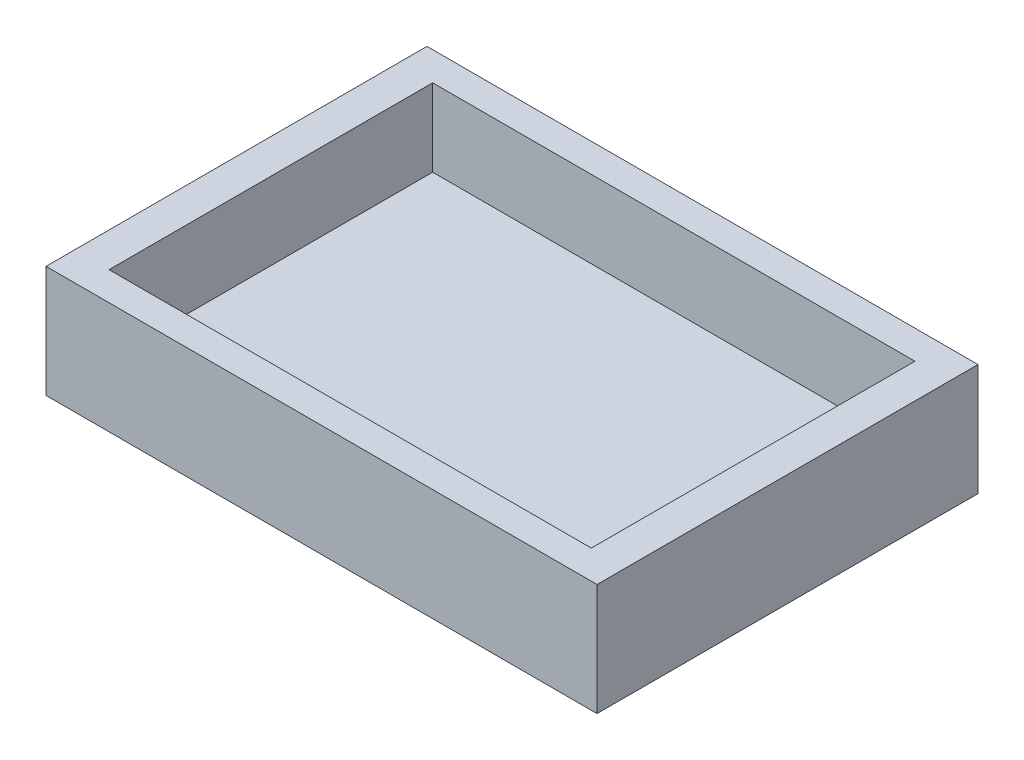
ISO-10303-21;
HEADER;
FILE_DESCRIPTION(('STEP AP214'),'2;1');
FILE_NAME('part.step','',(''),(''),'','','');
FILE_SCHEMA(('AUTOMOTIVE_DESIGN { 1 0 10303 214 1 1 1 1 }'));
ENDSEC;
DATA;
#1=APPLICATION_CONTEXT('core data for automotive mechanical design processes');
#2=APPLICATION_PROTOCOL_DEFINITION('international standard','automotive_design',2000,#1);
#3=PRODUCT_CONTEXT('',#1,'mechanical');
#4=PRODUCT('Part','Part','',(#3));
#5=PRODUCT_RELATED_PRODUCT_CATEGORY('part','',(#4));
#6=PRODUCT_DEFINITION_FORMATION('','',#4);
#7=PRODUCT_DEFINITION_CONTEXT('part definition',#1,'design');
#8=PRODUCT_DEFINITION('design','',#6,#7);
#9=PRODUCT_DEFINITION_SHAPE('','',#8);
#10=(LENGTH_UNIT() NAMED_UNIT(*) SI_UNIT(.MILLI.,.METRE.));
#11=(NAMED_UNIT(*) PLANE_ANGLE_UNIT() SI_UNIT($,.RADIAN.));
#12=(NAMED_UNIT(*) SI_UNIT($,.STERADIAN.) SOLID_ANGLE_UNIT());
#13=UNCERTAINTY_MEASURE_WITH_UNIT(LENGTH_MEASURE(1.E-05),#10,'distance_accuracy_value','');
#14=(GEOMETRIC_REPRESENTATION_CONTEXT(3) GLOBAL_UNCERTAINTY_ASSIGNED_CONTEXT((#13)) GLOBAL_UNIT_ASSIGNED_CONTEXT((#10,
#11,#12)) REPRESENTATION_CONTEXT('',''));
#15=CARTESIAN_POINT('',(0.,0.,0.));
#16=DIRECTION('',(0.,0.,1.));
#17=DIRECTION('',(1.,0.,0.));
#18=AXIS2_PLACEMENT_3D('',#15,#16,#17);
#19=CARTESIAN_POINT('',(48.8,6.,28.218726945));
#20=DIRECTION('',(0.,0.,1.));
#21=DIRECTION('',(1.,0.,0.));
#22=AXIS2_PLACEMENT_3D('',#19,#20,#21);
#23=PLANE('',#22);
#24=DIRECTION('',(0.,-1.,0.));
#25=VECTOR('',#24,1.);
#26=CARTESIAN_POINT('',(42.05,19.5,28.218726945));
#27=LINE('',#26,#25);
#28=CARTESIAN_POINT('',(42.05,19.5,28.218726945));
#29=VERTEX_POINT('',#28);
#30=CARTESIAN_POINT('',(42.05,6.,28.218726945));
#31=VERTEX_POINT('',#30);
#32=EDGE_CURVE('E110',#29,#31,#27,.T.);
#33=ORIENTED_EDGE('',*,*,#32,.T.);
#34=DIRECTION('',(1.,0.,0.));
#35=VECTOR('',#34,1.);
#36=CARTESIAN_POINT('',(48.8,6.,28.218726945));
#37=LINE('',#36,#35);
#38=CARTESIAN_POINT('',(-42.05,6.,28.218726945));
#39=VERTEX_POINT('',#38);
#40=EDGE_CURVE('E131',#39,#31,#37,.T.);
#41=ORIENTED_EDGE('',*,*,#40,.F.);
#42=DIRECTION('',(0.,-1.,0.));
#43=VECTOR('',#42,1.);
#44=CARTESIAN_POINT('',(-42.05,19.5,28.218726945));
#45=LINE('',#44,#43);
#46=CARTESIAN_POINT('',(-42.05,19.5,28.218726945));
#47=VERTEX_POINT('',#46);
#48=EDGE_CURVE('E52',#47,#39,#45,.T.);
#49=ORIENTED_EDGE('',*,*,#48,.F.);
#50=DIRECTION('',(1.,0.,0.));
#51=VECTOR('',#50,1.);
#52=CARTESIAN_POINT('',(48.8,19.5,28.218726945));
#53=LINE('',#52,#51);
#54=EDGE_CURVE('E124',#47,#29,#53,.T.);
#55=ORIENTED_EDGE('',*,*,#54,.T.);
#56=EDGE_LOOP('',(#33,#41,#49,#55));
#57=FACE_BOUND('',#56,.T.);
#58=ADVANCED_FACE('F37',(#57),#23,.F.);
#59=CARTESIAN_POINT('',(48.8,6.,-28.218726945));
#60=DIRECTION('',(0.,0.,-1.));
#61=DIRECTION('',(-1.,0.,0.));
#62=AXIS2_PLACEMENT_3D('',#59,#60,#61);
#63=PLANE('',#62);
#64=DIRECTION('',(0.,-1.,0.));
#65=VECTOR('',#64,1.);
#66=CARTESIAN_POINT('',(42.05,19.5,-28.218726945));
#67=LINE('',#66,#65);
#68=CARTESIAN_POINT('',(42.05,19.5,-28.218726945));
#69=VERTEX_POINT('',#68);
#70=CARTESIAN_POINT('',(42.05,6.,-28.218726945));
#71=VERTEX_POINT('',#70);
#72=EDGE_CURVE('E107',#69,#71,#67,.T.);
#73=ORIENTED_EDGE('',*,*,#72,.F.);
#74=DIRECTION('',(-1.,0.,0.));
#75=VECTOR('',#74,1.);
#76=CARTESIAN_POINT('',(48.8,19.5,-28.218726945));
#77=LINE('',#76,#75);
#78=CARTESIAN_POINT('',(-42.05,19.5,-28.218726945));
#79=VERTEX_POINT('',#78);
#80=EDGE_CURVE('E60',#69,#79,#77,.T.);
#81=ORIENTED_EDGE('',*,*,#80,.T.);
#82=DIRECTION('',(0.,-1.,0.));
#83=VECTOR('',#82,1.);
#84=CARTESIAN_POINT('',(-42.05,19.5,-28.218726945));
#85=LINE('',#84,#83);
#86=CARTESIAN_POINT('',(-42.05,6.,-28.218726945));
#87=VERTEX_POINT('',#86);
#88=EDGE_CURVE('E175',#79,#87,#85,.T.);
#89=ORIENTED_EDGE('',*,*,#88,.T.);
#90=DIRECTION('',(-1.,0.,0.));
#91=VECTOR('',#90,1.);
#92=CARTESIAN_POINT('',(48.8,6.,-28.218726945));
#93=LINE('',#92,#91);
#94=EDGE_CURVE('E116',#71,#87,#93,.T.);
#95=ORIENTED_EDGE('',*,*,#94,.F.);
#96=EDGE_LOOP('',(#73,#81,#89,#95));
#97=FACE_BOUND('',#96,.T.);
#98=ADVANCED_FACE('F115',(#97),#63,.F.);
#99=CARTESIAN_POINT('',(0.,6.,0.));
#100=DIRECTION('',(0.,-1.,0.));
#101=DIRECTION('',(0.,0.,-1.));
#102=AXIS2_PLACEMENT_3D('',#99,#100,#101);
#103=PLANE('',#102);
#104=DIRECTION('',(0.,0.,1.));
#105=VECTOR('',#104,1.);
#106=CARTESIAN_POINT('',(42.05,6.,-28.218726945));
#107=LINE('',#106,#105);
#108=EDGE_CURVE('E112',#71,#31,#107,.T.);
#109=ORIENTED_EDGE('',*,*,#108,.F.);
#110=ORIENTED_EDGE('',*,*,#94,.T.);
#111=DIRECTION('',(0.,0.,-1.));
#112=VECTOR('',#111,1.);
#113=CARTESIAN_POINT('',(-42.05,6.,-28.218726945));
#114=LINE('',#113,#112);
#115=EDGE_CURVE('E117',#39,#87,#114,.T.);
#116=ORIENTED_EDGE('',*,*,#115,.F.);
#117=ORIENTED_EDGE('',*,*,#40,.T.);
#118=EDGE_LOOP('',(#109,#110,#116,#117));
#119=FACE_BOUND('',#118,.T.);
#120=ADVANCED_FACE('F171',(#119),#103,.F.);
#121=CARTESIAN_POINT('',(48.8,6.,33.218726945));
#122=DIRECTION('',(0.,0.,-1.));
#123=DIRECTION('',(-1.,0.,0.));
#124=AXIS2_PLACEMENT_3D('',#121,#122,#123);
#125=PLANE('',#124);
#126=DIRECTION('',(1.,0.,0.));
#127=VECTOR('',#126,1.);
#128=CARTESIAN_POINT('',(0.,19.5,33.218726945));
#129=LINE('',#128,#127);
#130=CARTESIAN_POINT('',(-48.05,19.5,33.218726945));
#131=VERTEX_POINT('',#130);
#132=CARTESIAN_POINT('',(48.05,19.5,33.218726945));
#133=VERTEX_POINT('',#132);
#134=EDGE_CURVE('E134',#131,#133,#129,.T.);
#135=ORIENTED_EDGE('',*,*,#134,.F.);
#136=DIRECTION('',(0.,1.,0.));
#137=VECTOR('',#136,1.);
#138=CARTESIAN_POINT('',(-48.05,0.,33.218726945));
#139=LINE('',#138,#137);
#140=CARTESIAN_POINT('',(-48.05,0.,33.218726945));
#141=VERTEX_POINT('',#140);
#142=EDGE_CURVE('E144',#141,#131,#139,.T.);
#143=ORIENTED_EDGE('',*,*,#142,.F.);
#144=DIRECTION('',(1.,0.,0.));
#145=VECTOR('',#144,1.);
#146=CARTESIAN_POINT('',(48.8,0.,33.218726945));
#147=LINE('',#146,#145);
#148=CARTESIAN_POINT('',(48.05,0.,33.218726945));
#149=VERTEX_POINT('',#148);
#150=EDGE_CURVE('E45',#141,#149,#147,.T.);
#151=ORIENTED_EDGE('',*,*,#150,.T.);
#152=DIRECTION('',(0.,-1.,0.));
#153=VECTOR('',#152,1.);
#154=CARTESIAN_POINT('',(48.05,0.,33.218726945));
#155=LINE('',#154,#153);
#156=EDGE_CURVE('E128',#133,#149,#155,.T.);
#157=ORIENTED_EDGE('',*,*,#156,.F.);
#158=EDGE_LOOP('',(#135,#143,#151,#157));
#159=FACE_BOUND('',#158,.T.);
#160=ADVANCED_FACE('F39',(#159),#125,.F.);
#161=CARTESIAN_POINT('',(48.8,6.,-33.218726945));
#162=DIRECTION('',(0.,0.,1.));
#163=DIRECTION('',(1.,0.,0.));
#164=AXIS2_PLACEMENT_3D('',#161,#162,#163);
#165=PLANE('',#164);
#166=DIRECTION('',(-1.,0.,0.));
#167=VECTOR('',#166,1.);
#168=CARTESIAN_POINT('',(48.8,0.,-33.218726945));
#169=LINE('',#168,#167);
#170=CARTESIAN_POINT('',(48.05,0.,-33.218726945));
#171=VERTEX_POINT('',#170);
#172=CARTESIAN_POINT('',(-48.05,0.,-33.218726945));
#173=VERTEX_POINT('',#172);
#174=EDGE_CURVE('E11',#171,#173,#169,.T.);
#175=ORIENTED_EDGE('',*,*,#174,.T.);
#176=DIRECTION('',(0.,-1.,0.));
#177=VECTOR('',#176,1.);
#178=CARTESIAN_POINT('',(-48.05,0.,-33.218726945));
#179=LINE('',#178,#177);
#180=CARTESIAN_POINT('',(-48.05,19.5,-33.218726945));
#181=VERTEX_POINT('',#180);
#182=EDGE_CURVE('E162',#181,#173,#179,.T.);
#183=ORIENTED_EDGE('',*,*,#182,.F.);
#184=DIRECTION('',(-1.,0.,0.));
#185=VECTOR('',#184,1.);
#186=CARTESIAN_POINT('',(0.,19.5,-33.218726945));
#187=LINE('',#186,#185);
#188=CARTESIAN_POINT('',(48.05,19.5,-33.218726945));
#189=VERTEX_POINT('',#188);
#190=EDGE_CURVE('E136',#189,#181,#187,.T.);
#191=ORIENTED_EDGE('',*,*,#190,.F.);
#192=DIRECTION('',(0.,1.,0.));
#193=VECTOR('',#192,1.);
#194=CARTESIAN_POINT('',(48.05,0.,-33.218726945));
#195=LINE('',#194,#193);
#196=EDGE_CURVE('E163',#171,#189,#195,.T.);
#197=ORIENTED_EDGE('',*,*,#196,.F.);
#198=EDGE_LOOP('',(#175,#183,#191,#197));
#199=FACE_BOUND('',#198,.T.);
#200=ADVANCED_FACE('F160',(#199),#165,.F.);
#201=CARTESIAN_POINT('',(0.,0.,0.));
#202=DIRECTION('',(0.,-1.,0.));
#203=DIRECTION('',(0.,0.,-1.));
#204=AXIS2_PLACEMENT_3D('',#201,#202,#203);
#205=PLANE('',#204);
#206=DIRECTION('',(0.,0.,1.));
#207=VECTOR('',#206,1.);
#208=CARTESIAN_POINT('',(-48.05,0.,-33.218726945));
#209=LINE('',#208,#207);
#210=EDGE_CURVE('E157',#173,#141,#209,.T.);
#211=ORIENTED_EDGE('',*,*,#210,.F.);
#212=ORIENTED_EDGE('',*,*,#174,.F.);
#213=DIRECTION('',(0.,0.,-1.));
#214=VECTOR('',#213,1.);
#215=CARTESIAN_POINT('',(48.05,0.,-33.218726945));
#216=LINE('',#215,#214);
#217=EDGE_CURVE('E125',#149,#171,#216,.T.);
#218=ORIENTED_EDGE('',*,*,#217,.F.);
#219=ORIENTED_EDGE('',*,*,#150,.F.);
#220=EDGE_LOOP('',(#211,#212,#218,#219));
#221=FACE_BOUND('',#220,.T.);
#222=ADVANCED_FACE('F156',(#221),#205,.T.);
#223=CARTESIAN_POINT('',(0.,19.5,0.));
#224=DIRECTION('',(0.,1.,0.));
#225=DIRECTION('',(0.,0.,1.));
#226=AXIS2_PLACEMENT_3D('',#223,#224,#225);
#227=PLANE('',#226);
#228=ORIENTED_EDGE('',*,*,#80,.F.);
#229=DIRECTION('',(0.,0.,1.));
#230=VECTOR('',#229,1.);
#231=CARTESIAN_POINT('',(42.05,19.5,-28.218726945));
#232=LINE('',#231,#230);
#233=EDGE_CURVE('E105',#69,#29,#232,.T.);
#234=ORIENTED_EDGE('',*,*,#233,.T.);
#235=ORIENTED_EDGE('',*,*,#54,.F.);
#236=DIRECTION('',(0.,0.,-1.));
#237=VECTOR('',#236,1.);
#238=CARTESIAN_POINT('',(-42.05,19.5,-28.218726945));
#239=LINE('',#238,#237);
#240=EDGE_CURVE('E122',#47,#79,#239,.T.);
#241=ORIENTED_EDGE('',*,*,#240,.T.);
#242=EDGE_LOOP('',(#228,#234,#235,#241));
#243=FACE_BOUND('',#242,.T.);
#244=ORIENTED_EDGE('',*,*,#190,.T.);
#245=DIRECTION('',(0.,0.,-1.));
#246=VECTOR('',#245,1.);
#247=CARTESIAN_POINT('',(-48.05,19.5,-33.218726945));
#248=LINE('',#247,#246);
#249=EDGE_CURVE('E164',#131,#181,#248,.T.);
#250=ORIENTED_EDGE('',*,*,#249,.F.);
#251=ORIENTED_EDGE('',*,*,#134,.T.);
#252=DIRECTION('',(0.,0.,1.));
#253=VECTOR('',#252,1.);
#254=CARTESIAN_POINT('',(48.05,19.5,-33.218726945));
#255=LINE('',#254,#253);
#256=EDGE_CURVE('E153',#189,#133,#255,.T.);
#257=ORIENTED_EDGE('',*,*,#256,.F.);
#258=EDGE_LOOP('',(#244,#250,#251,#257));
#259=FACE_BOUND('',#258,.T.);
#260=ADVANCED_FACE('F119',(#243,#259),#227,.T.);
#261=CARTESIAN_POINT('',(48.05,0.,0.));
#262=DIRECTION('',(1.,0.,0.));
#263=DIRECTION('',(0.,0.,-1.));
#264=AXIS2_PLACEMENT_3D('',#261,#262,#263);
#265=PLANE('',#264);
#266=ORIENTED_EDGE('',*,*,#196,.T.);
#267=ORIENTED_EDGE('',*,*,#256,.T.);
#268=ORIENTED_EDGE('',*,*,#156,.T.);
#269=ORIENTED_EDGE('',*,*,#217,.T.);
#270=EDGE_LOOP('',(#266,#267,#268,#269));
#271=FACE_BOUND('',#270,.T.);
#272=ADVANCED_FACE('F151',(#271),#265,.T.);
#273=CARTESIAN_POINT('',(-48.05,0.,0.));
#274=DIRECTION('',(1.,0.,0.));
#275=DIRECTION('',(0.,0.,-1.));
#276=AXIS2_PLACEMENT_3D('',#273,#274,#275);
#277=PLANE('',#276);
#278=ORIENTED_EDGE('',*,*,#249,.T.);
#279=ORIENTED_EDGE('',*,*,#182,.T.);
#280=ORIENTED_EDGE('',*,*,#210,.T.);
#281=ORIENTED_EDGE('',*,*,#142,.T.);
#282=EDGE_LOOP('',(#278,#279,#280,#281));
#283=FACE_BOUND('',#282,.T.);
#284=ADVANCED_FACE('F183',(#283),#277,.F.);
#285=CARTESIAN_POINT('',(-42.05,19.5,-28.218726945));
#286=DIRECTION('',(-1.,0.,0.));
#287=DIRECTION('',(0.,0.,1.));
#288=AXIS2_PLACEMENT_3D('',#285,#286,#287);
#289=PLANE('',#288);
#290=ORIENTED_EDGE('',*,*,#115,.T.);
#291=ORIENTED_EDGE('',*,*,#88,.F.);
#292=ORIENTED_EDGE('',*,*,#240,.F.);
#293=ORIENTED_EDGE('',*,*,#48,.T.);
#294=EDGE_LOOP('',(#290,#291,#292,#293));
#295=FACE_BOUND('',#294,.T.);
#296=ADVANCED_FACE('F174',(#295),#289,.F.);
#297=CARTESIAN_POINT('',(42.05,19.5,-28.218726945));
#298=DIRECTION('',(1.,0.,0.));
#299=DIRECTION('',(0.,0.,-1.));
#300=AXIS2_PLACEMENT_3D('',#297,#298,#299);
#301=PLANE('',#300);
#302=ORIENTED_EDGE('',*,*,#108,.T.);
#303=ORIENTED_EDGE('',*,*,#32,.F.);
#304=ORIENTED_EDGE('',*,*,#233,.F.);
#305=ORIENTED_EDGE('',*,*,#72,.T.);
#306=EDGE_LOOP('',(#302,#303,#304,#305));
#307=FACE_BOUND('',#306,.T.);
#308=ADVANCED_FACE('F106',(#307),#301,.F.);
#309=CLOSED_SHELL('',(#58,#98,#120,#160,#200,#222,#260,#272,#284,#296,#308));
#310=MANIFOLD_SOLID_BREP('B2',#309);
#311=ADVANCED_BREP_SHAPE_REPRESENTATION('',(#18,#310),#14);
#312=SHAPE_DEFINITION_REPRESENTATION(#9,#311);
ENDSEC;
END-ISO-10303-21;
